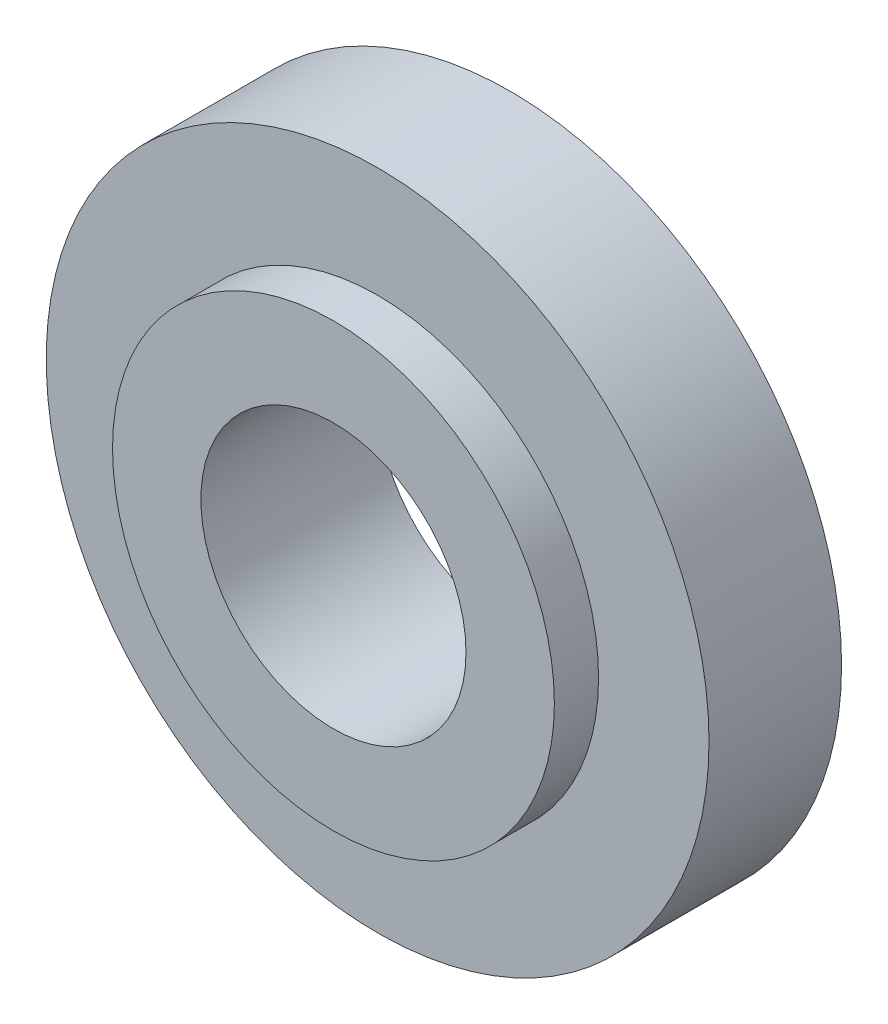
ISO-10303-21;
HEADER;
FILE_DESCRIPTION(('STEP AP214'),'2;1');
FILE_NAME('part.step','',(''),(''),'','','');
FILE_SCHEMA(('AUTOMOTIVE_DESIGN { 1 0 10303 214 1 1 1 1 }'));
ENDSEC;
DATA;
#1=APPLICATION_CONTEXT('core data for automotive mechanical design processes');
#2=APPLICATION_PROTOCOL_DEFINITION('international standard','automotive_design',2000,#1);
#3=PRODUCT_CONTEXT('',#1,'mechanical');
#4=PRODUCT('Part','Part','',(#3));
#5=PRODUCT_RELATED_PRODUCT_CATEGORY('part','',(#4));
#6=PRODUCT_DEFINITION_FORMATION('','',#4);
#7=PRODUCT_DEFINITION_CONTEXT('part definition',#1,'design');
#8=PRODUCT_DEFINITION('design','',#6,#7);
#9=PRODUCT_DEFINITION_SHAPE('','',#8);
#10=(LENGTH_UNIT() NAMED_UNIT(*) SI_UNIT(.MILLI.,.METRE.));
#11=(NAMED_UNIT(*) PLANE_ANGLE_UNIT() SI_UNIT($,.RADIAN.));
#12=(NAMED_UNIT(*) SI_UNIT($,.STERADIAN.) SOLID_ANGLE_UNIT());
#13=UNCERTAINTY_MEASURE_WITH_UNIT(LENGTH_MEASURE(1.E-05),#10,'distance_accuracy_value','');
#14=(GEOMETRIC_REPRESENTATION_CONTEXT(3) GLOBAL_UNCERTAINTY_ASSIGNED_CONTEXT((#13)) GLOBAL_UNIT_ASSIGNED_CONTEXT((#10,
#11,#12)) REPRESENTATION_CONTEXT('',''));
#15=CARTESIAN_POINT('',(0.,0.,0.));
#16=DIRECTION('',(0.,0.,1.));
#17=DIRECTION('',(1.,0.,0.));
#18=AXIS2_PLACEMENT_3D('',#15,#16,#17);
#19=CARTESIAN_POINT('',(0.,0.,1.5));
#20=DIRECTION('',(0.,0.,-1.));
#21=DIRECTION('',(-1.,0.,0.));
#22=AXIS2_PLACEMENT_3D('',#19,#20,#21);
#23=CYLINDRICAL_SURFACE('',#22,3.75);
#24=CARTESIAN_POINT('',(0.,0.,1.5));
#25=DIRECTION('',(0.,0.,1.));
#26=DIRECTION('',(1.,0.,0.));
#27=AXIS2_PLACEMENT_3D('',#24,#25,#26);
#28=CIRCLE('',#27,3.75);
#29=CARTESIAN_POINT('',(3.75,0.,1.5));
#30=VERTEX_POINT('',#29);
#31=EDGE_CURVE('E46',#30,#30,#28,.T.);
#32=ORIENTED_EDGE('',*,*,#31,.F.);
#33=EDGE_LOOP('',(#32));
#34=FACE_BOUND('',#33,.T.);
#35=CARTESIAN_POINT('',(0.,0.,0.));
#36=DIRECTION('',(0.,0.,1.));
#37=DIRECTION('',(1.,0.,0.));
#38=AXIS2_PLACEMENT_3D('',#35,#36,#37);
#39=CIRCLE('',#38,3.75);
#40=CARTESIAN_POINT('',(3.75,0.,0.));
#41=VERTEX_POINT('',#40);
#42=EDGE_CURVE('E52',#41,#41,#39,.T.);
#43=ORIENTED_EDGE('',*,*,#42,.T.);
#44=EDGE_LOOP('',(#43));
#45=FACE_BOUND('',#44,.T.);
#46=ADVANCED_FACE('F38',(#34,#45),#23,.T.);
#47=CARTESIAN_POINT('',(0.,0.,1.5));
#48=DIRECTION('',(0.,0.,1.));
#49=DIRECTION('',(1.,0.,0.));
#50=AXIS2_PLACEMENT_3D('',#47,#48,#49);
#51=PLANE('',#50);
#52=CARTESIAN_POINT('',(0.,0.,1.5));
#53=DIRECTION('',(0.,0.,1.));
#54=DIRECTION('',(1.,0.,0.));
#55=AXIS2_PLACEMENT_3D('',#52,#53,#54);
#56=CIRCLE('',#55,2.5);
#57=CARTESIAN_POINT('',(2.5,0.,1.5));
#58=VERTEX_POINT('',#57);
#59=EDGE_CURVE('E10',#58,#58,#56,.T.);
#60=ORIENTED_EDGE('',*,*,#59,.F.);
#61=EDGE_LOOP('',(#60));
#62=FACE_BOUND('',#61,.T.);
#63=ORIENTED_EDGE('',*,*,#31,.T.);
#64=EDGE_LOOP('',(#63));
#65=FACE_BOUND('',#64,.T.);
#66=ADVANCED_FACE('F88',(#62,#65),#51,.T.);
#67=CARTESIAN_POINT('',(0.,0.,0.));
#68=DIRECTION('',(0.,0.,1.));
#69=DIRECTION('',(1.,0.,0.));
#70=AXIS2_PLACEMENT_3D('',#67,#68,#69);
#71=PLANE('',#70);
#72=CARTESIAN_POINT('',(0.,0.,0.));
#73=DIRECTION('',(0.,0.,1.));
#74=DIRECTION('',(1.,0.,0.));
#75=AXIS2_PLACEMENT_3D('',#72,#73,#74);
#76=CIRCLE('',#75,1.5);
#77=CARTESIAN_POINT('',(1.5,0.,0.));
#78=VERTEX_POINT('',#77);
#79=EDGE_CURVE('E67',#78,#78,#76,.T.);
#80=ORIENTED_EDGE('',*,*,#79,.T.);
#81=EDGE_LOOP('',(#80));
#82=FACE_BOUND('',#81,.T.);
#83=ORIENTED_EDGE('',*,*,#42,.F.);
#84=EDGE_LOOP('',(#83));
#85=FACE_BOUND('',#84,.T.);
#86=ADVANCED_FACE('F74',(#82,#85),#71,.F.);
#87=CARTESIAN_POINT('',(0.,0.,2.));
#88=DIRECTION('',(0.,0.,-1.));
#89=DIRECTION('',(-1.,0.,0.));
#90=AXIS2_PLACEMENT_3D('',#87,#88,#89);
#91=CYLINDRICAL_SURFACE('',#90,2.5);
#92=CARTESIAN_POINT('',(0.,0.,2.));
#93=DIRECTION('',(0.,0.,1.));
#94=DIRECTION('',(1.,0.,0.));
#95=AXIS2_PLACEMENT_3D('',#92,#93,#94);
#96=CIRCLE('',#95,2.5);
#97=CARTESIAN_POINT('',(2.5,0.,2.));
#98=VERTEX_POINT('',#97);
#99=EDGE_CURVE('E55',#98,#98,#96,.T.);
#100=ORIENTED_EDGE('',*,*,#99,.F.);
#101=EDGE_LOOP('',(#100));
#102=FACE_BOUND('',#101,.T.);
#103=ORIENTED_EDGE('',*,*,#59,.T.);
#104=EDGE_LOOP('',(#103));
#105=FACE_BOUND('',#104,.T.);
#106=ADVANCED_FACE('F84',(#102,#105),#91,.T.);
#107=CARTESIAN_POINT('',(0.,0.,2.));
#108=DIRECTION('',(0.,0.,1.));
#109=DIRECTION('',(1.,0.,0.));
#110=AXIS2_PLACEMENT_3D('',#107,#108,#109);
#111=PLANE('',#110);
#112=CARTESIAN_POINT('',(0.,0.,2.));
#113=DIRECTION('',(0.,0.,1.));
#114=DIRECTION('',(1.,0.,0.));
#115=AXIS2_PLACEMENT_3D('',#112,#113,#114);
#116=CIRCLE('',#115,1.5);
#117=CARTESIAN_POINT('',(1.5,0.,2.));
#118=VERTEX_POINT('',#117);
#119=EDGE_CURVE('E41',#118,#118,#116,.T.);
#120=ORIENTED_EDGE('',*,*,#119,.F.);
#121=EDGE_LOOP('',(#120));
#122=FACE_BOUND('',#121,.T.);
#123=ORIENTED_EDGE('',*,*,#99,.T.);
#124=EDGE_LOOP('',(#123));
#125=FACE_BOUND('',#124,.T.);
#126=ADVANCED_FACE('F79',(#122,#125),#111,.T.);
#127=CARTESIAN_POINT('',(0.,0.,0.));
#128=DIRECTION('',(0.,0.,1.));
#129=DIRECTION('',(1.,0.,0.));
#130=AXIS2_PLACEMENT_3D('',#127,#128,#129);
#131=CYLINDRICAL_SURFACE('',#130,1.5);
#132=ORIENTED_EDGE('',*,*,#119,.T.);
#133=EDGE_LOOP('',(#132));
#134=FACE_BOUND('',#133,.T.);
#135=ORIENTED_EDGE('',*,*,#79,.F.);
#136=EDGE_LOOP('',(#135));
#137=FACE_BOUND('',#136,.T.);
#138=ADVANCED_FACE('F77',(#134,#137),#131,.F.);
#139=CLOSED_SHELL('',(#46,#66,#86,#106,#126,#138));
#140=MANIFOLD_SOLID_BREP('B2',#139);
#141=ADVANCED_BREP_SHAPE_REPRESENTATION('',(#18,#140),#14);
#142=SHAPE_DEFINITION_REPRESENTATION(#9,#141);
ENDSEC;
END-ISO-10303-21;
